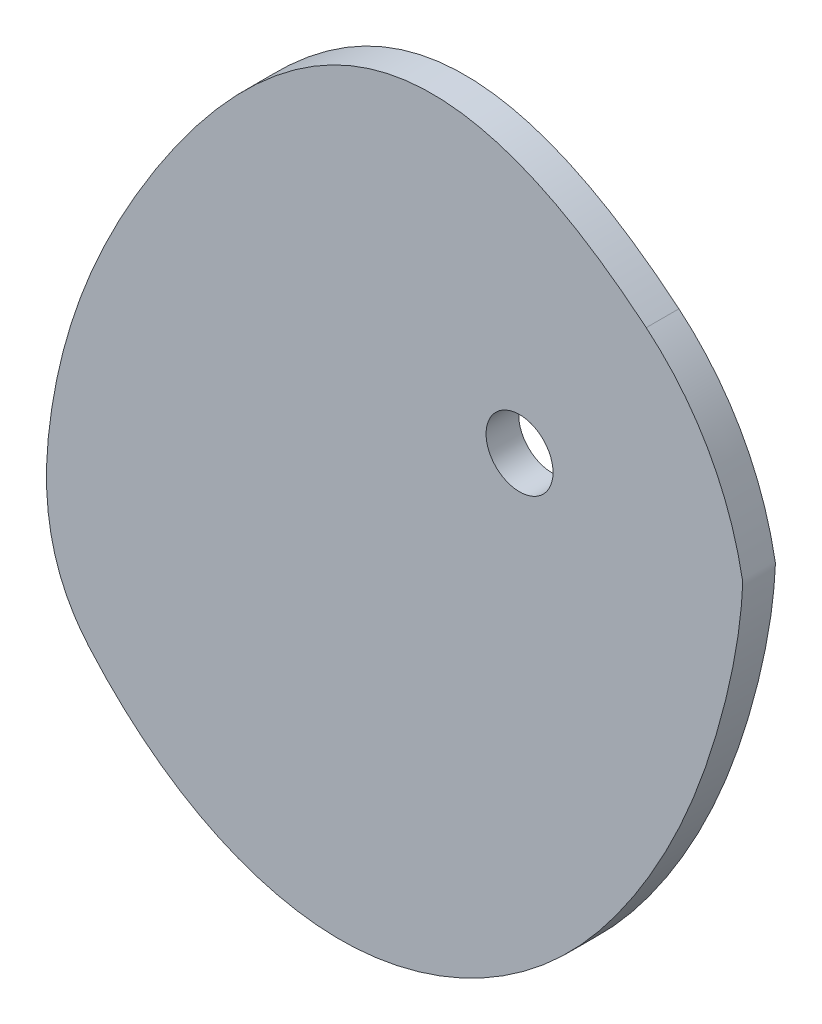
ISO-10303-21;
HEADER;
FILE_DESCRIPTION(('STEP AP214'),'2;1');
FILE_NAME('part.step','',(''),(''),'','','');
FILE_SCHEMA(('AUTOMOTIVE_DESIGN { 1 0 10303 214 1 1 1 1 }'));
ENDSEC;
DATA;
#1=APPLICATION_CONTEXT('core data for automotive mechanical design processes');
#2=APPLICATION_PROTOCOL_DEFINITION('international standard','automotive_design',2000,#1);
#3=PRODUCT_CONTEXT('',#1,'mechanical');
#4=PRODUCT('Part','Part','',(#3));
#5=PRODUCT_RELATED_PRODUCT_CATEGORY('part','',(#4));
#6=PRODUCT_DEFINITION_FORMATION('','',#4);
#7=PRODUCT_DEFINITION_CONTEXT('part definition',#1,'design');
#8=PRODUCT_DEFINITION('design','',#6,#7);
#9=PRODUCT_DEFINITION_SHAPE('','',#8);
#10=(LENGTH_UNIT() NAMED_UNIT(*) SI_UNIT(.MILLI.,.METRE.));
#11=(NAMED_UNIT(*) PLANE_ANGLE_UNIT() SI_UNIT($,.RADIAN.));
#12=(NAMED_UNIT(*) SI_UNIT($,.STERADIAN.) SOLID_ANGLE_UNIT());
#13=UNCERTAINTY_MEASURE_WITH_UNIT(LENGTH_MEASURE(1.E-05),#10,'distance_accuracy_value','');
#14=(GEOMETRIC_REPRESENTATION_CONTEXT(3) GLOBAL_UNCERTAINTY_ASSIGNED_CONTEXT((#13)) GLOBAL_UNIT_ASSIGNED_CONTEXT((#10,
#11,#12)) REPRESENTATION_CONTEXT('',''));
#15=CARTESIAN_POINT('',(0.,0.,0.));
#16=DIRECTION('',(0.,0.,1.));
#17=DIRECTION('',(1.,0.,0.));
#18=AXIS2_PLACEMENT_3D('',#15,#16,#17);
#19=CARTESIAN_POINT('',(7.71807474307275,-33.8368167261019,1.5));
#20=DIRECTION('',(0.,0.,-1.));
#21=DIRECTION('',(-1.,0.,0.));
#22=AXIS2_PLACEMENT_3D('',#19,#20,#21);
#23=PLANE('',#22);
#24=CARTESIAN_POINT('',(-39.5544444870828,-35.1462981177619,1.5));
#25=CARTESIAN_POINT('',(-39.358922612783,-35.3715326887149,1.5));
#26=CARTESIAN_POINT('',(-38.9540860339733,-35.8284917567379,1.5));
#27=CARTESIAN_POINT('',(-38.3276353774772,-36.5060874280174,1.5));
#28=CARTESIAN_POINT('',(-37.6764436056514,-37.1796902643212,1.5));
#29=CARTESIAN_POINT('',(-37.0098722078979,-37.8383530008867,1.5));
#30=CARTESIAN_POINT('',(-36.3279302416366,-38.4812682495489,1.5));
#31=CARTESIAN_POINT('',(-35.6306660204234,-39.1076125464556,1.5));
#32=CARTESIAN_POINT('',(-34.9181679882581,-39.7165478833897,1.5));
#33=CARTESIAN_POINT('',(-34.1905655429424,-40.307223271675,1.5));
#34=CARTESIAN_POINT('',(-33.4480298076208,-40.8787763369773,1.5));
#35=CARTESIAN_POINT('',(-32.6907743495492,-41.4303349434676,1.5));
#36=CARTESIAN_POINT('',(-31.9190558452327,-41.9610188457408,1.5));
#37=CARTESIAN_POINT('',(-31.133174691109,-42.4699413668835,1.5));
#38=CARTESIAN_POINT('',(-30.3334755590224,-42.9562111010658,1.5));
#39=CARTESIAN_POINT('',(-29.5203478957779,-43.418933639023,1.5));
#40=CARTESIAN_POINT('',(-28.6942263661276,-43.8572133147889,1.5));
#41=CARTESIAN_POINT('',(-27.8555912385906,-44.2701549720404,1.5));
#42=CARTESIAN_POINT('',(-27.004968713562,-44.6568657484273,1.5));
#43=CARTESIAN_POINT('',(-26.14293119322,-45.0164568762241,1.5));
#44=CARTESIAN_POINT('',(-25.2700974927675,-45.3480454978447,1.5));
#45=CARTESIAN_POINT('',(-24.387132992651,-45.6507564940651,1.5));
#46=CARTESIAN_POINT('',(-23.4947497311914,-45.923724325493,1.5));
#47=CARTESIAN_POINT('',(-22.593706437982,-46.1660948778948,1.5));
#48=CARTESIAN_POINT('',(-21.6848085050926,-46.3770273391642,1.5));
#49=CARTESIAN_POINT('',(-20.7689079055466,-46.555695997133,1.5));
#50=CARTESIAN_POINT('',(-19.8469030221643,-46.701292364813,1.5));
#51=CARTESIAN_POINT('',(-18.9197385229323,-46.8130261082193,1.5));
#52=CARTESIAN_POINT('',(-17.9884047726616,-46.8901304645867,1.5));
#53=CARTESIAN_POINT('',(-17.0539386851103,-46.931850896192,1.5));
#54=CARTESIAN_POINT('',(-16.117432396557,-46.9374963223158,1.5));
#55=CARTESIAN_POINT('',(-15.1801571086734,-46.9062626640521,1.5));
#56=CARTESIAN_POINT('',(-14.2435413441607,-46.838649177854,1.5));
#57=CARTESIAN_POINT('',(-13.3090710955244,-46.7354825382011,1.5));
#58=CARTESIAN_POINT('',(-12.37822691134,-46.5975745730414,1.5));
#59=CARTESIAN_POINT('',(-11.4524314715149,-46.4258094989323,1.5));
#60=CARTESIAN_POINT('',(-10.5330494778171,-46.2211169878181,1.5));
#61=CARTESIAN_POINT('',(-9.62138560420746,-45.9844762103712,1.5));
#62=CARTESIAN_POINT('',(-8.71868313496123,-45.7169115127396,1.5));
#63=CARTESIAN_POINT('',(-7.82612252849821,-45.4194902812363,1.5));
#64=CARTESIAN_POINT('',(-6.94482011336627,-45.0933201677765,1.5));
#65=CARTESIAN_POINT('',(-6.07582686293552,-44.739546437356,1.5));
#66=CARTESIAN_POINT('',(-5.22012726484347,-44.3593492371521,1.5));
#67=CARTESIAN_POINT('',(-4.37863828244712,-43.9539408445366,1.5));
#68=CARTESIAN_POINT('',(-3.55220841040438,-43.5245628823457,1.5));
#69=CARTESIAN_POINT('',(-2.74161682504487,-43.0724835082429,1.5));
#70=CARTESIAN_POINT('',(-1.94757263042904,-42.5989945800961,1.5));
#71=CARTESIAN_POINT('',(-1.17071420078488,-42.1054088006218,1.5));
#72=CARTESIAN_POINT('',(-0.411608619923912,-41.5930568442032,1.5));
#73=CARTESIAN_POINT('',(0.329248781873173,-41.0632844688905,1.5));
#74=CARTESIAN_POINT('',(1.05143479311586,-40.5174496165534,1.5));
#75=CARTESIAN_POINT('',(1.75459858822349,-39.9569195041642,1.5));
#76=CARTESIAN_POINT('',(2.43846189632423,-39.3830677091711,1.5));
#77=CARTESIAN_POINT('',(3.10281907164175,-38.7972712519024,1.5));
#78=CARTESIAN_POINT('',(3.74753706551844,-38.2009076779476,1.5));
#79=CARTESIAN_POINT('',(4.37255530007519,-37.5953521433349,1.5));
#80=CARTESIAN_POINT('',(4.9778854441677,-36.9819745056728,1.5));
#81=CARTESIAN_POINT('',(5.56361109036168,-36.3621364230052,1.5));
#82=CARTESIAN_POINT('',(6.12988733928237,-35.7371884671816,1.5));
#83=CARTESIAN_POINT('',(6.67694027021398,-35.1084672398066,1.5));
#84=CARTESIAN_POINT('',(7.20506637819823,-34.4772925473642,1.5));
#85=CARTESIAN_POINT('',(7.71463168710209,-33.8449644407859,1.5));
#86=CARTESIAN_POINT('',(8.2060716058787,-33.2127608443537,1.5));
#87=CARTESIAN_POINT('',(8.67988763229483,-32.5819331365514,1.5));
#88=CARTESIAN_POINT('',(9.13665513265686,-31.9537093233693,1.5));
#89=CARTESIAN_POINT('',(9.57699457003816,-31.3292636325808,1.5));
#90=CARTESIAN_POINT('',(10.001748030579,-30.7097021113565,1.5));
#91=CARTESIAN_POINT('',(10.6728953529739,-29.7037509149289,1.5));
#92=CARTESIAN_POINT('',(11.4285255180468,-28.5085199739359,1.5));
#93=CARTESIAN_POINT('',(12.2463178889677,-27.1247449334052,1.5));
#94=CARTESIAN_POINT('',(12.8912373891065,-25.9739832646977,1.5));
#95=CARTESIAN_POINT('',(13.4896927776539,-24.8485466399926,1.5));
#96=CARTESIAN_POINT('',(14.0449592480052,-23.7486863519835,1.5));
#97=CARTESIAN_POINT('',(14.5601863231691,-22.6744517367552,1.5));
#98=CARTESIAN_POINT('',(15.1136642138259,-21.4606145219403,1.5));
#99=CARTESIAN_POINT('',(15.6906591322934,-20.1142216949659,1.5));
#100=CARTESIAN_POINT('',(16.3376925022695,-18.4901931478938,1.5));
#101=CARTESIAN_POINT('',(16.9132599036732,-16.9212268187084,1.5));
#102=CARTESIAN_POINT('',(17.4267301008518,-15.4048511676651,1.5));
#103=CARTESIAN_POINT('',(17.7978659631665,-14.233065689047,1.5));
#104=CARTESIAN_POINT('',(18.0970167741192,-13.2351984199488,1.5));
#105=CARTESIAN_POINT('',(18.3360757961279,-12.4020724225654,1.5));
#106=CARTESIAN_POINT('',(18.5605687041785,-11.5844538270901,1.5));
#107=CARTESIAN_POINT('',(18.7714916127831,-10.7810401192135,1.5));
#108=CARTESIAN_POINT('',(18.9696684888434,-9.9905235675942,1.5));
#109=CARTESIAN_POINT('',(19.1557546501379,-9.21160423786371,1.5));
#110=CARTESIAN_POINT('',(19.3302412296265,-8.44300271378482,1.5));
#111=CARTESIAN_POINT('',(19.4934604178924,-7.68347236295817,1.5));
#112=CARTESIAN_POINT('',(19.6455914800321,-6.93181112997889,1.5));
#113=CARTESIAN_POINT('',(19.78666750374,-6.18687281311489,1.5));
#114=CARTESIAN_POINT('',(19.9165828396003,-5.44757778700615,1.5));
#115=CARTESIAN_POINT('',(20.0351011897351,-4.71292313391322,1.5));
#116=CARTESIAN_POINT('',(20.1418642813012,-3.98199214875794,1.5));
#117=CARTESIAN_POINT('',(20.2364008071128,-3.25396320313288,1.5));
#118=CARTESIAN_POINT('',(20.3045813330545,-2.64845867565189,1.5));
#119=CARTESIAN_POINT('',(20.3523719936208,-2.16501520230985,1.5));
#120=CARTESIAN_POINT('',(20.3846745430352,-1.80313905280818,1.5));
#121=CARTESIAN_POINT('',(20.413598625125,-1.44151630817452,1.5));
#122=CARTESIAN_POINT('',(20.4382228217089,-1.08015727369233,1.5));
#123=CARTESIAN_POINT('',(20.4615010259034,-0.718796446256137,1.5));
#124=CARTESIAN_POINT('',(20.4719283397311,-0.358233382684977,1.5));
#125=CARTESIAN_POINT('',(20.5121933908656,0.00758361115845464,1.5));
#126=CARTESIAN_POINT('',(20.420294324754,0.36628230395133,1.5));
#127=CARTESIAN_POINT('',(20.3582043411198,0.727998488578303,1.5));
#128=CARTESIAN_POINT('',(20.2826051360891,1.08640625439275,1.5));
#129=CARTESIAN_POINT('',(20.205316122332,1.44228377935077,1.5));
#130=CARTESIAN_POINT('',(20.1232593077228,1.79542415256536,1.5));
#131=CARTESIAN_POINT('',(20.0373167971483,2.14588285981109,1.5));
#132=CARTESIAN_POINT('',(19.8879620145056,2.7229821762264,1.5));
#133=CARTESIAN_POINT('',(19.5966981500653,3.74223041252151,1.5));
#134=CARTESIAN_POINT('',(19.1447223143901,5.06791195317302,1.5));
#135=CARTESIAN_POINT('',(18.58141924284,6.45645516331668,1.5));
#136=CARTESIAN_POINT('',(18.0055609212407,7.69265439017453,1.5));
#137=CARTESIAN_POINT('',(17.3743995134691,8.88531752136341,1.5));
#138=CARTESIAN_POINT('',(16.6891685779871,10.0339125109065,1.5));
#139=CARTESIAN_POINT('',(15.9508812610411,11.1376453830478,1.5));
#140=CARTESIAN_POINT('',(15.1603927615922,12.1954281763943,1.5));
#141=CARTESIAN_POINT('',(14.3184668636801,13.2058582232271,1.5));
#142=CARTESIAN_POINT('',(13.4258434729328,14.1672062802542,1.5));
#143=CARTESIAN_POINT('',(12.53007751279,15.0322477578094,1.5));
#144=CARTESIAN_POINT('',(11.9207785240764,15.5630782868637,1.5));
#145=CARTESIAN_POINT('',(11.634950811413,15.8003214485946,1.5));
#146=B_SPLINE_CURVE_WITH_KNOTS('',3,(#24,#25,#26,#27,#28,#29,#30,#31,#32,#33,#34,#35,#36,#37,
#38,#39,#40,#41,#42,#43,#44,#45,#46,#47,#48,#49,#50,#51,#52,#53,#54,#55,#56,#57,#58,#59,#60,#61,
#62,#63,#64,#65,#66,#67,#68,#69,#70,#71,#72,#73,#74,#75,#76,#77,#78,#79,#80,#81,#82,#83,#84,#85,
#86,#87,#88,#89,#90,#91,#92,#93,#94,#95,#96,#97,#98,#99,#100,#101,#102,#103,#104,#105,#106,#107,
#108,#109,#110,#111,#112,#113,#114,#115,#116,#117,#118,#119,#120,#121,#122,#123,#124,#125,#126,
#127,#128,#129,#130,#131,#132,#133,#134,#135,#136,#137,#138,#139,#140,#141,#142,#143,#144,#145),
.UNSPECIFIED.,.F.,.F.,(4,1,1,1,1,1,1,1,1,1,1,1,1,1,1,1,1,1,1,1,1,1,1,1,1,1,1,1,1,1,1,1,1,1,1,1,
1,1,1,1,1,1,1,1,1,1,1,1,1,1,1,1,1,1,1,1,1,1,1,1,1,1,1,1,1,1,1,1,1,1,1,1,1,1,1,1,1,1,1,1,1,1,1,1,
1,1,1,1,1,1,1,1,1,1,1,1,1,1,1,1,1,1,1,1,1,1,1,1,1,1,1,1,1,1,1,1,1,1,1,4),(0.561512543915868,
0.565782527567126,0.570252104668917,0.57472291987726,0.579194638894886,0.583666924099619,
0.588139439416691,0.592611855238536,0.597083853402432,0.601555132236205,0.606025411681864,
0.610494438506485,0.614961991608931,0.619427887429995,0.623891985472355,0.628354193935213,
0.632814475466727,0.637272853035195,0.641729415917556,0.646184325800905,0.650637822989553,
0.655090232706571,0.659541971474758,0.663993553557616,0.668445597436172,0.672898832292425,
0.677354104464873,0.6818123838361,0.686274770106807,0.690742498905239,0.695216754459362,
0.699697324974414,0.704183212682017,0.708673273659155,0.7131662319308,0.717660689763857,
0.722155137343837,0.726647961862329,0.731137456047538,0.735621826173181,0.740099199583222,
0.744567631771418,0.749025113055694,0.753469574888048,0.757898895841225,0.76231090731386,
0.766703398996338,0.771074124140268,0.775420804675432,0.779741136219337,0.784032793026208,
0.788293432924513,0.792520702295008,0.796712241144912,0.800865688338389,0.804978687049038,
0.809048890506943,0.813073968120973,0.817051612066944,0.820979544444003,0.824855525115645,
0.828677360368422,0.832442912540997,0.836150110799296,0.839796963260422,0.843381676299789,
0.846904129843305,0.857109335382751,0.863622561031699,0.869914329655403,0.875993807495379,
0.881870128005402,0.88755239179538,0.893049665162577,0.900968457418533,0.908521612405097,
0.918075537746338,0.924891610650607,0.931440482673757,0.935671970655968,0.939805497802741,
0.943849063315756,0.947810448525198,0.951697190151447,0.955516553806828,0.959275508459856,
0.962980702580304,0.966638442638464,0.970254674548643,0.973834968531598,0.977384507732466,
0.980908080781265,0.984410078333624,0.987894493490927,0.989631247743111,0.99136492587983,
0.993095917593301,0.994824589077076,0.99655128341379,0.998276320999325,1.,1.00176420338918,
1.00351949178347,1.0052660957307,1.0070042441421,1.0087341642592,1.01045608162048,
1.01217022002793,1.01726817279731,1.02562954169016,1.03221207066273,1.03871387458968,
1.04514728547405,1.05152405008419,1.05785530678872,1.06415156687227,1.07042270069822,
1.07667792887127,1.08292581834711,1.0882437861591),.UNSPECIFIED.);
#147=CARTESIAN_POINT('',(-39.5544444870828,-35.1462981177619,1.5));
#148=VERTEX_POINT('',#147);
#149=CARTESIAN_POINT('',(11.634950811413,15.8003214485945,1.5));
#150=VERTEX_POINT('',#149);
#151=EDGE_CURVE('E65',#148,#150,#146,.T.);
#152=ORIENTED_EDGE('',*,*,#151,.T.);
#153=CARTESIAN_POINT('',(11.634950811413,15.8003214485945,1.5));
#154=CARTESIAN_POINT('',(0.0280559042533952,25.4342943758248,1.5));
#155=CARTESIAN_POINT('',(-17.4140207116637,27.2489550212151,1.5));
#156=CARTESIAN_POINT('',(-35.8950466580405,4.24235475020675,1.5));
#157=CARTESIAN_POINT('',(-43.9854274642927,-15.8283755060338,1.5));
#158=CARTESIAN_POINT('',(-43.7845108584807,-30.2734050582164,1.5));
#159=CARTESIAN_POINT('',(-39.5544444870828,-35.1462981177619,1.5));
#160=B_SPLINE_CURVE_WITH_KNOTS('',3,(#153,#154,#155,#156,#157,#158,#159),.UNSPECIFIED.,.F.,.F.,
(4,1,1,1,4),(0.,0.30925101458344,0.582243378070436,0.820016729691515,1.),.UNSPECIFIED.);
#161=EDGE_CURVE('E50',#150,#148,#160,.T.);
#162=ORIENTED_EDGE('',*,*,#161,.T.);
#163=EDGE_LOOP('',(#152,#162));
#164=FACE_BOUND('',#163,.T.);
#165=CARTESIAN_POINT('',(0.,0.,1.5));
#166=DIRECTION('',(0.,0.,1.));
#167=DIRECTION('',(1.,0.,0.));
#168=AXIS2_PLACEMENT_3D('',#165,#166,#167);
#169=CIRCLE('',#168,3.075);
#170=CARTESIAN_POINT('',(3.075,0.,1.5));
#171=VERTEX_POINT('',#170);
#172=EDGE_CURVE('E71',#171,#171,#169,.T.);
#173=ORIENTED_EDGE('',*,*,#172,.F.);
#174=EDGE_LOOP('',(#173));
#175=FACE_BOUND('',#174,.T.);
#176=ADVANCED_FACE('F33',(#164,#175),#23,.F.);
#177=CARTESIAN_POINT('',(7.71807474307275,-33.8368167261019,-1.5));
#178=DIRECTION('',(0.,0.,-1.));
#179=DIRECTION('',(-1.,0.,0.));
#180=AXIS2_PLACEMENT_3D('',#177,#178,#179);
#181=PLANE('',#180);
#182=CARTESIAN_POINT('',(-39.5544444870828,-35.1462981177619,-1.5));
#183=CARTESIAN_POINT('',(-39.358922612783,-35.3715326887149,-1.5));
#184=CARTESIAN_POINT('',(-38.9540860339733,-35.8284917567379,-1.5));
#185=CARTESIAN_POINT('',(-38.3276353774772,-36.5060874280174,-1.5));
#186=CARTESIAN_POINT('',(-37.6764436056514,-37.1796902643212,-1.5));
#187=CARTESIAN_POINT('',(-37.0098722078979,-37.8383530008867,-1.5));
#188=CARTESIAN_POINT('',(-36.3279302416366,-38.4812682495489,-1.5));
#189=CARTESIAN_POINT('',(-35.6306660204234,-39.1076125464556,-1.5));
#190=CARTESIAN_POINT('',(-34.9181679882581,-39.7165478833897,-1.5));
#191=CARTESIAN_POINT('',(-34.1905655429424,-40.307223271675,-1.5));
#192=CARTESIAN_POINT('',(-33.4480298076208,-40.8787763369773,-1.5));
#193=CARTESIAN_POINT('',(-32.6907743495492,-41.4303349434676,-1.5));
#194=CARTESIAN_POINT('',(-31.9190558452327,-41.9610188457408,-1.5));
#195=CARTESIAN_POINT('',(-31.133174691109,-42.4699413668835,-1.5));
#196=CARTESIAN_POINT('',(-30.3334755590224,-42.9562111010658,-1.5));
#197=CARTESIAN_POINT('',(-29.5203478957779,-43.418933639023,-1.5));
#198=CARTESIAN_POINT('',(-28.6942263661276,-43.8572133147889,-1.5));
#199=CARTESIAN_POINT('',(-27.8555912385906,-44.2701549720404,-1.5));
#200=CARTESIAN_POINT('',(-27.004968713562,-44.6568657484273,-1.5));
#201=CARTESIAN_POINT('',(-26.14293119322,-45.0164568762241,-1.5));
#202=CARTESIAN_POINT('',(-25.2700974927675,-45.3480454978447,-1.5));
#203=CARTESIAN_POINT('',(-24.387132992651,-45.6507564940651,-1.5));
#204=CARTESIAN_POINT('',(-23.4947497311914,-45.923724325493,-1.5));
#205=CARTESIAN_POINT('',(-22.593706437982,-46.1660948778948,-1.5));
#206=CARTESIAN_POINT('',(-21.6848085050926,-46.3770273391642,-1.5));
#207=CARTESIAN_POINT('',(-20.7689079055466,-46.555695997133,-1.5));
#208=CARTESIAN_POINT('',(-19.8469030221643,-46.701292364813,-1.5));
#209=CARTESIAN_POINT('',(-18.9197385229323,-46.8130261082193,-1.5));
#210=CARTESIAN_POINT('',(-17.9884047726616,-46.8901304645867,-1.5));
#211=CARTESIAN_POINT('',(-17.0539386851103,-46.931850896192,-1.5));
#212=CARTESIAN_POINT('',(-16.117432396557,-46.9374963223158,-1.5));
#213=CARTESIAN_POINT('',(-15.1801571086734,-46.9062626640521,-1.5));
#214=CARTESIAN_POINT('',(-14.2435413441607,-46.838649177854,-1.5));
#215=CARTESIAN_POINT('',(-13.3090710955244,-46.7354825382011,-1.5));
#216=CARTESIAN_POINT('',(-12.37822691134,-46.5975745730414,-1.5));
#217=CARTESIAN_POINT('',(-11.4524314715149,-46.4258094989323,-1.5));
#218=CARTESIAN_POINT('',(-10.5330494778171,-46.2211169878181,-1.5));
#219=CARTESIAN_POINT('',(-9.62138560420746,-45.9844762103712,-1.5));
#220=CARTESIAN_POINT('',(-8.71868313496123,-45.7169115127396,-1.5));
#221=CARTESIAN_POINT('',(-7.82612252849821,-45.4194902812363,-1.5));
#222=CARTESIAN_POINT('',(-6.94482011336627,-45.0933201677765,-1.5));
#223=CARTESIAN_POINT('',(-6.07582686293552,-44.739546437356,-1.5));
#224=CARTESIAN_POINT('',(-5.22012726484347,-44.3593492371521,-1.5));
#225=CARTESIAN_POINT('',(-4.37863828244712,-43.9539408445366,-1.5));
#226=CARTESIAN_POINT('',(-3.55220841040438,-43.5245628823457,-1.5));
#227=CARTESIAN_POINT('',(-2.74161682504487,-43.0724835082429,-1.5));
#228=CARTESIAN_POINT('',(-1.94757263042904,-42.5989945800961,-1.5));
#229=CARTESIAN_POINT('',(-1.17071420078488,-42.1054088006218,-1.5));
#230=CARTESIAN_POINT('',(-0.411608619923912,-41.5930568442032,-1.5));
#231=CARTESIAN_POINT('',(0.329248781873173,-41.0632844688905,-1.5));
#232=CARTESIAN_POINT('',(1.05143479311586,-40.5174496165534,-1.5));
#233=CARTESIAN_POINT('',(1.75459858822349,-39.9569195041642,-1.5));
#234=CARTESIAN_POINT('',(2.43846189632423,-39.3830677091711,-1.5));
#235=CARTESIAN_POINT('',(3.10281907164175,-38.7972712519024,-1.5));
#236=CARTESIAN_POINT('',(3.74753706551844,-38.2009076779476,-1.5));
#237=CARTESIAN_POINT('',(4.37255530007519,-37.5953521433349,-1.5));
#238=CARTESIAN_POINT('',(4.9778854441677,-36.9819745056728,-1.5));
#239=CARTESIAN_POINT('',(5.56361109036168,-36.3621364230052,-1.5));
#240=CARTESIAN_POINT('',(6.12988733928237,-35.7371884671816,-1.5));
#241=CARTESIAN_POINT('',(6.67694027021398,-35.1084672398066,-1.5));
#242=CARTESIAN_POINT('',(7.20506637819823,-34.4772925473642,-1.5));
#243=CARTESIAN_POINT('',(7.71463168710209,-33.8449644407859,-1.5));
#244=CARTESIAN_POINT('',(8.2060716058787,-33.2127608443537,-1.5));
#245=CARTESIAN_POINT('',(8.67988763229483,-32.5819331365514,-1.5));
#246=CARTESIAN_POINT('',(9.13665513265686,-31.9537093233693,-1.5));
#247=CARTESIAN_POINT('',(9.57699457003816,-31.3292636325808,-1.5));
#248=CARTESIAN_POINT('',(10.001748030579,-30.7097021113565,-1.5));
#249=CARTESIAN_POINT('',(10.6728953529739,-29.7037509149289,-1.5));
#250=CARTESIAN_POINT('',(11.4285255180468,-28.5085199739359,-1.5));
#251=CARTESIAN_POINT('',(12.2463178889677,-27.1247449334052,-1.5));
#252=CARTESIAN_POINT('',(12.8912373891065,-25.9739832646977,-1.5));
#253=CARTESIAN_POINT('',(13.4896927776539,-24.8485466399926,-1.5));
#254=CARTESIAN_POINT('',(14.0449592480052,-23.7486863519835,-1.5));
#255=CARTESIAN_POINT('',(14.5601863231691,-22.6744517367552,-1.5));
#256=CARTESIAN_POINT('',(15.1136642138259,-21.4606145219403,-1.5));
#257=CARTESIAN_POINT('',(15.6906591322934,-20.1142216949659,-1.5));
#258=CARTESIAN_POINT('',(16.3376925022695,-18.4901931478938,-1.5));
#259=CARTESIAN_POINT('',(16.9132599036732,-16.9212268187084,-1.5));
#260=CARTESIAN_POINT('',(17.4267301008518,-15.4048511676651,-1.5));
#261=CARTESIAN_POINT('',(17.7978659631665,-14.233065689047,-1.5));
#262=CARTESIAN_POINT('',(18.0970167741192,-13.2351984199488,-1.5));
#263=CARTESIAN_POINT('',(18.3360757961279,-12.4020724225654,-1.5));
#264=CARTESIAN_POINT('',(18.5605687041785,-11.5844538270901,-1.5));
#265=CARTESIAN_POINT('',(18.7714916127831,-10.7810401192135,-1.5));
#266=CARTESIAN_POINT('',(18.9696684888434,-9.9905235675942,-1.5));
#267=CARTESIAN_POINT('',(19.1557546501379,-9.21160423786371,-1.5));
#268=CARTESIAN_POINT('',(19.3302412296265,-8.44300271378482,-1.5));
#269=CARTESIAN_POINT('',(19.4934604178924,-7.68347236295817,-1.5));
#270=CARTESIAN_POINT('',(19.6455914800321,-6.93181112997889,-1.5));
#271=CARTESIAN_POINT('',(19.78666750374,-6.18687281311489,-1.5));
#272=CARTESIAN_POINT('',(19.9165828396003,-5.44757778700615,-1.5));
#273=CARTESIAN_POINT('',(20.0351011897351,-4.71292313391322,-1.5));
#274=CARTESIAN_POINT('',(20.1418642813012,-3.98199214875794,-1.5));
#275=CARTESIAN_POINT('',(20.2364008071128,-3.25396320313288,-1.5));
#276=CARTESIAN_POINT('',(20.3045813330545,-2.64845867565189,-1.5));
#277=CARTESIAN_POINT('',(20.3523719936208,-2.16501520230985,-1.5));
#278=CARTESIAN_POINT('',(20.3846745430352,-1.80313905280818,-1.5));
#279=CARTESIAN_POINT('',(20.413598625125,-1.44151630817452,-1.5));
#280=CARTESIAN_POINT('',(20.4382228217089,-1.08015727369233,-1.5));
#281=CARTESIAN_POINT('',(20.4615010259034,-0.718796446256137,-1.5));
#282=CARTESIAN_POINT('',(20.4719283397311,-0.358233382684977,-1.5));
#283=CARTESIAN_POINT('',(20.5121933908656,0.00758361115845464,-1.5));
#284=CARTESIAN_POINT('',(20.420294324754,0.36628230395133,-1.5));
#285=CARTESIAN_POINT('',(20.3582043411198,0.727998488578303,-1.5));
#286=CARTESIAN_POINT('',(20.2826051360891,1.08640625439275,-1.5));
#287=CARTESIAN_POINT('',(20.205316122332,1.44228377935077,-1.5));
#288=CARTESIAN_POINT('',(20.1232593077228,1.79542415256536,-1.5));
#289=CARTESIAN_POINT('',(20.0373167971483,2.14588285981109,-1.5));
#290=CARTESIAN_POINT('',(19.8879620145056,2.7229821762264,-1.5));
#291=CARTESIAN_POINT('',(19.5966981500653,3.74223041252151,-1.5));
#292=CARTESIAN_POINT('',(19.1447223143901,5.06791195317302,-1.5));
#293=CARTESIAN_POINT('',(18.58141924284,6.45645516331668,-1.5));
#294=CARTESIAN_POINT('',(18.0055609212407,7.69265439017453,-1.5));
#295=CARTESIAN_POINT('',(17.3743995134691,8.88531752136341,-1.5));
#296=CARTESIAN_POINT('',(16.6891685779871,10.0339125109065,-1.5));
#297=CARTESIAN_POINT('',(15.9508812610411,11.1376453830478,-1.5));
#298=CARTESIAN_POINT('',(15.1603927615922,12.1954281763943,-1.5));
#299=CARTESIAN_POINT('',(14.3184668636801,13.2058582232271,-1.5));
#300=CARTESIAN_POINT('',(13.4258434729328,14.1672062802542,-1.5));
#301=CARTESIAN_POINT('',(12.53007751279,15.0322477578094,-1.5));
#302=CARTESIAN_POINT('',(11.9207785240764,15.5630782868637,-1.5));
#303=CARTESIAN_POINT('',(11.634950811413,15.8003214485946,-1.5));
#304=B_SPLINE_CURVE_WITH_KNOTS('',3,(#182,#183,#184,#185,#186,#187,#188,#189,#190,#191,#192,
#193,#194,#195,#196,#197,#198,#199,#200,#201,#202,#203,#204,#205,#206,#207,#208,#209,#210,#211,
#212,#213,#214,#215,#216,#217,#218,#219,#220,#221,#222,#223,#224,#225,#226,#227,#228,#229,#230,
#231,#232,#233,#234,#235,#236,#237,#238,#239,#240,#241,#242,#243,#244,#245,#246,#247,#248,#249,
#250,#251,#252,#253,#254,#255,#256,#257,#258,#259,#260,#261,#262,#263,#264,#265,#266,#267,#268,
#269,#270,#271,#272,#273,#274,#275,#276,#277,#278,#279,#280,#281,#282,#283,#284,#285,#286,#287,
#288,#289,#290,#291,#292,#293,#294,#295,#296,#297,#298,#299,#300,#301,#302,#303),.UNSPECIFIED.,
.F.,.F.,(4,1,1,1,1,1,1,1,1,1,1,1,1,1,1,1,1,1,1,1,1,1,1,1,1,1,1,1,1,1,1,1,1,1,1,1,1,1,1,1,1,1,1,
1,1,1,1,1,1,1,1,1,1,1,1,1,1,1,1,1,1,1,1,1,1,1,1,1,1,1,1,1,1,1,1,1,1,1,1,1,1,1,1,1,1,1,1,1,1,1,1,
1,1,1,1,1,1,1,1,1,1,1,1,1,1,1,1,1,1,1,1,1,1,1,1,1,1,1,1,4),(0.561512543915868,0.565782527567126,
0.570252104668917,0.57472291987726,0.579194638894886,0.583666924099619,0.588139439416691,
0.592611855238536,0.597083853402432,0.601555132236205,0.606025411681864,0.610494438506485,
0.614961991608931,0.619427887429995,0.623891985472355,0.628354193935213,0.632814475466727,
0.637272853035195,0.641729415917556,0.646184325800905,0.650637822989553,0.655090232706571,
0.659541971474758,0.663993553557616,0.668445597436172,0.672898832292425,0.677354104464873,
0.6818123838361,0.686274770106807,0.690742498905239,0.695216754459362,0.699697324974414,
0.704183212682017,0.708673273659155,0.7131662319308,0.717660689763857,0.722155137343837,
0.726647961862329,0.731137456047538,0.735621826173181,0.740099199583222,0.744567631771418,
0.749025113055694,0.753469574888048,0.757898895841225,0.76231090731386,0.766703398996338,
0.771074124140268,0.775420804675432,0.779741136219337,0.784032793026208,0.788293432924513,
0.792520702295008,0.796712241144912,0.800865688338389,0.804978687049038,0.809048890506943,
0.813073968120973,0.817051612066944,0.820979544444003,0.824855525115645,0.828677360368422,
0.832442912540997,0.836150110799296,0.839796963260422,0.843381676299789,0.846904129843305,
0.857109335382751,0.863622561031699,0.869914329655403,0.875993807495379,0.881870128005402,
0.88755239179538,0.893049665162577,0.900968457418533,0.908521612405097,0.918075537746338,
0.924891610650607,0.931440482673757,0.935671970655968,0.939805497802741,0.943849063315756,
0.947810448525198,0.951697190151447,0.955516553806828,0.959275508459856,0.962980702580304,
0.966638442638464,0.970254674548643,0.973834968531598,0.977384507732466,0.980908080781265,
0.984410078333624,0.987894493490927,0.989631247743111,0.99136492587983,0.993095917593301,
0.994824589077076,0.99655128341379,0.998276320999325,1.,1.00176420338918,1.00351949178347,
1.0052660957307,1.0070042441421,1.0087341642592,1.01045608162048,1.01217022002793,
1.01726817279731,1.02562954169016,1.03221207066273,1.03871387458968,1.04514728547405,
1.05152405008419,1.05785530678872,1.06415156687227,1.07042270069822,1.07667792887127,
1.08292581834711,1.0882437861591),.UNSPECIFIED.);
#305=CARTESIAN_POINT('',(-39.5544444870828,-35.1462981177619,-1.5));
#306=VERTEX_POINT('',#305);
#307=CARTESIAN_POINT('',(11.634950811413,15.8003214485945,-1.5));
#308=VERTEX_POINT('',#307);
#309=EDGE_CURVE('E66',#306,#308,#304,.T.);
#310=ORIENTED_EDGE('',*,*,#309,.F.);
#311=CARTESIAN_POINT('',(11.634950811413,15.8003214485945,-1.5));
#312=CARTESIAN_POINT('',(0.0280559042533952,25.4342943758248,-1.5));
#313=CARTESIAN_POINT('',(-17.4140207116637,27.2489550212151,-1.5));
#314=CARTESIAN_POINT('',(-35.8950466580405,4.24235475020675,-1.5));
#315=CARTESIAN_POINT('',(-43.9854274642927,-15.8283755060338,-1.5));
#316=CARTESIAN_POINT('',(-43.7845108584807,-30.2734050582164,-1.5));
#317=CARTESIAN_POINT('',(-39.5544444870828,-35.1462981177619,-1.5));
#318=B_SPLINE_CURVE_WITH_KNOTS('',3,(#311,#312,#313,#314,#315,#316,#317),.UNSPECIFIED.,.F.,.F.,
(4,1,1,1,4),(0.,0.30925101458344,0.582243378070436,0.820016729691515,1.),.UNSPECIFIED.);
#319=EDGE_CURVE('E58',#308,#306,#318,.T.);
#320=ORIENTED_EDGE('',*,*,#319,.F.);
#321=EDGE_LOOP('',(#310,#320));
#322=FACE_BOUND('',#321,.T.);
#323=CARTESIAN_POINT('',(0.,0.,-1.5));
#324=DIRECTION('',(0.,0.,1.));
#325=DIRECTION('',(1.,0.,0.));
#326=AXIS2_PLACEMENT_3D('',#323,#324,#325);
#327=CIRCLE('',#326,3.075);
#328=CARTESIAN_POINT('',(3.075,0.,-1.5));
#329=VERTEX_POINT('',#328);
#330=EDGE_CURVE('E74',#329,#329,#327,.T.);
#331=ORIENTED_EDGE('',*,*,#330,.T.);
#332=EDGE_LOOP('',(#331));
#333=FACE_BOUND('',#332,.T.);
#334=ADVANCED_FACE('F69',(#322,#333),#181,.T.);
#335=DIRECTION('',(0.,0.,-1.));
#336=VECTOR('',#335,1.);
#337=SURFACE_OF_LINEAR_EXTRUSION('',#146,#336);
#338=ORIENTED_EDGE('',*,*,#309,.T.);
#339=DIRECTION('',(0.,0.,-1.));
#340=VECTOR('',#339,1.);
#341=CARTESIAN_POINT('',(11.634950811413,15.8003214485945,1.5));
#342=LINE('',#341,#340);
#343=EDGE_CURVE('E11',#150,#308,#342,.T.);
#344=ORIENTED_EDGE('',*,*,#343,.F.);
#345=ORIENTED_EDGE('',*,*,#151,.F.);
#346=DIRECTION('',(0.,0.,-1.));
#347=VECTOR('',#346,1.);
#348=CARTESIAN_POINT('',(-39.5544444870828,-35.1462981177619,1.5));
#349=LINE('',#348,#347);
#350=EDGE_CURVE('E43',#148,#306,#349,.T.);
#351=ORIENTED_EDGE('',*,*,#350,.T.);
#352=EDGE_LOOP('',(#338,#344,#345,#351));
#353=FACE_BOUND('',#352,.T.);
#354=ADVANCED_FACE('F35',(#353),#337,.F.);
#355=DIRECTION('',(0.,0.,-1.));
#356=VECTOR('',#355,1.);
#357=SURFACE_OF_LINEAR_EXTRUSION('',#160,#356);
#358=ORIENTED_EDGE('',*,*,#319,.T.);
#359=ORIENTED_EDGE('',*,*,#350,.F.);
#360=ORIENTED_EDGE('',*,*,#161,.F.);
#361=ORIENTED_EDGE('',*,*,#343,.T.);
#362=EDGE_LOOP('',(#358,#359,#360,#361));
#363=FACE_BOUND('',#362,.T.);
#364=ADVANCED_FACE('F61',(#363),#357,.F.);
#365=CARTESIAN_POINT('',(0.,0.,1.5));
#366=DIRECTION('',(0.,0.,-1.));
#367=DIRECTION('',(-1.,0.,0.));
#368=AXIS2_PLACEMENT_3D('',#365,#366,#367);
#369=CYLINDRICAL_SURFACE('',#368,3.075);
#370=ORIENTED_EDGE('',*,*,#172,.T.);
#371=EDGE_LOOP('',(#370));
#372=FACE_BOUND('',#371,.T.);
#373=ORIENTED_EDGE('',*,*,#330,.F.);
#374=EDGE_LOOP('',(#373));
#375=FACE_BOUND('',#374,.T.);
#376=ADVANCED_FACE('F99',(#372,#375),#369,.F.);
#377=CLOSED_SHELL('',(#176,#334,#354,#364,#376));
#378=MANIFOLD_SOLID_BREP('B2',#377);
#379=ADVANCED_BREP_SHAPE_REPRESENTATION('',(#18,#378),#14);
#380=SHAPE_DEFINITION_REPRESENTATION(#9,#379);
ENDSEC;
END-ISO-10303-21;
